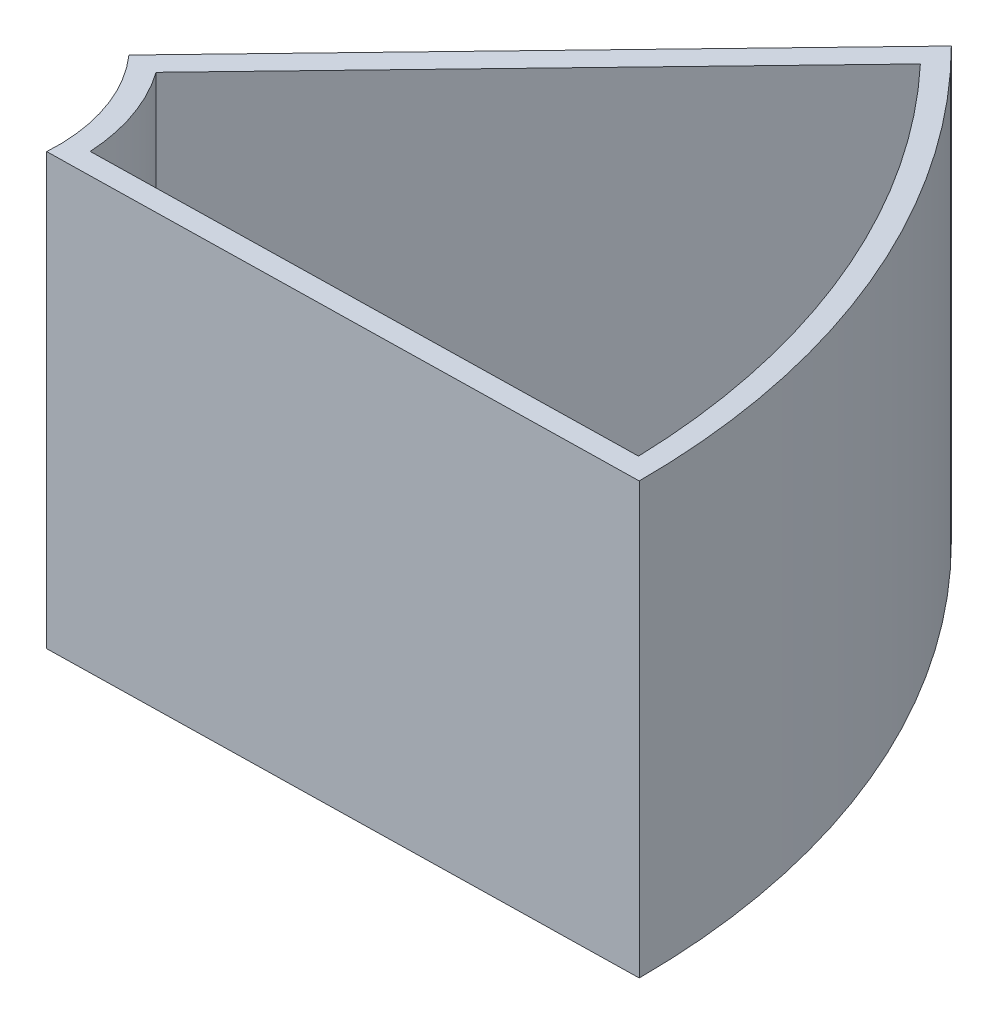
ISO-10303-21;
HEADER;
FILE_DESCRIPTION(('STEP AP214'),'2;1');
FILE_NAME('part.step','',(''),(''),'','','');
FILE_SCHEMA(('AUTOMOTIVE_DESIGN { 1 0 10303 214 1 1 1 1 }'));
ENDSEC;
DATA;
#1=APPLICATION_CONTEXT('core data for automotive mechanical design processes');
#2=APPLICATION_PROTOCOL_DEFINITION('international standard','automotive_design',2000,#1);
#3=PRODUCT_CONTEXT('',#1,'mechanical');
#4=PRODUCT('Part','Part','',(#3));
#5=PRODUCT_RELATED_PRODUCT_CATEGORY('part','',(#4));
#6=PRODUCT_DEFINITION_FORMATION('','',#4);
#7=PRODUCT_DEFINITION_CONTEXT('part definition',#1,'design');
#8=PRODUCT_DEFINITION('design','',#6,#7);
#9=PRODUCT_DEFINITION_SHAPE('','',#8);
#10=(LENGTH_UNIT() NAMED_UNIT(*) SI_UNIT(.MILLI.,.METRE.));
#11=(NAMED_UNIT(*) PLANE_ANGLE_UNIT() SI_UNIT($,.RADIAN.));
#12=(NAMED_UNIT(*) SI_UNIT($,.STERADIAN.) SOLID_ANGLE_UNIT());
#13=UNCERTAINTY_MEASURE_WITH_UNIT(LENGTH_MEASURE(1.E-05),#10,'distance_accuracy_value','');
#14=(GEOMETRIC_REPRESENTATION_CONTEXT(3) GLOBAL_UNCERTAINTY_ASSIGNED_CONTEXT((#13)) GLOBAL_UNIT_ASSIGNED_CONTEXT((#10,
#11,#12)) REPRESENTATION_CONTEXT('',''));
#15=CARTESIAN_POINT('',(0.,0.,0.));
#16=DIRECTION('',(0.,0.,1.));
#17=DIRECTION('',(1.,0.,0.));
#18=AXIS2_PLACEMENT_3D('',#15,#16,#17);
#19=CARTESIAN_POINT('',(0.,100.,0.));
#20=DIRECTION('',(0.,1.,0.));
#21=DIRECTION('',(0.,0.,1.));
#22=AXIS2_PLACEMENT_3D('',#19,#20,#21);
#23=PLANE('',#22);
#24=CARTESIAN_POINT('',(0.,100.,0.));
#25=DIRECTION('',(0.,1.,0.));
#26=DIRECTION('',(0.,0.,1.));
#27=AXIS2_PLACEMENT_3D('',#24,#25,#26);
#28=CIRCLE('',#27,175.);
#29=CARTESIAN_POINT('',(175.,100.,0.));
#30=VERTEX_POINT('',#29);
#31=CARTESIAN_POINT('',(123.743686707646,100.,-123.743686707646));
#32=VERTEX_POINT('',#31);
#33=EDGE_CURVE('E139',#30,#32,#28,.T.);
#34=ORIENTED_EDGE('',*,*,#33,.T.);
#35=DIRECTION('',(-0.693507503530502,0.,0.720449403183104));
#36=VECTOR('',#35,1.);
#37=CARTESIAN_POINT('',(123.743686707646,100.,-123.743686707646));
#38=LINE('',#37,#36);
#39=CARTESIAN_POINT('',(30.045678616437,100.,-26.4056281212505));
#40=VERTEX_POINT('',#39);
#41=EDGE_CURVE('E142',#32,#40,#38,.T.);
#42=ORIENTED_EDGE('',*,*,#41,.T.);
#43=CARTESIAN_POINT('',(0.,100.,0.));
#44=DIRECTION('',(0.,-1.,0.));
#45=DIRECTION('',(0.,0.,1.));
#46=AXIS2_PLACEMENT_3D('',#43,#44,#45);
#47=CIRCLE('',#46,40.);
#48=CARTESIAN_POINT('',(39.9171018010607,100.,2.57390438900788));
#49=VERTEX_POINT('',#48);
#50=EDGE_CURVE('E145',#40,#49,#47,.T.);
#51=ORIENTED_EDGE('',*,*,#50,.T.);
#52=DIRECTION('',(0.999818517042745,0.,-0.0190507999424009));
#53=VECTOR('',#52,1.);
#54=CARTESIAN_POINT('',(175.,100.,0.));
#55=LINE('',#54,#53);
#56=EDGE_CURVE('E147',#49,#30,#55,.T.);
#57=ORIENTED_EDGE('',*,*,#56,.T.);
#58=EDGE_LOOP('',(#34,#42,#51,#57));
#59=FACE_BOUND('',#58,.T.);
#60=DIRECTION('',(0.999818517042745,0.,-0.0190507999424007));
#61=VECTOR('',#60,1.);
#62=CARTESIAN_POINT('',(169.929243976333,100.,-4.9042880861415));
#63=LINE('',#62,#61);
#64=CARTESIAN_POINT('',(44.9292439763331,100.,-2.52250584045592));
#65=VERTEX_POINT('',#64);
#66=CARTESIAN_POINT('',(169.929243976333,100.,-4.90428808614151));
#67=VERTEX_POINT('',#66);
#68=EDGE_CURVE('E128',#65,#67,#63,.T.);
#69=ORIENTED_EDGE('',*,*,#68,.F.);
#70=CARTESIAN_POINT('',(0.,100.,0.));
#71=DIRECTION('',(0.,-1.,0.));
#72=DIRECTION('',(0.,0.,-1.));
#73=AXIS2_PLACEMENT_3D('',#70,#71,#72);
#74=CIRCLE('',#73,45.);
#75=CARTESIAN_POINT('',(36.672129032149,100.,-26.0797805253306));
#76=VERTEX_POINT('',#75);
#77=EDGE_CURVE('E121',#76,#65,#74,.T.);
#78=ORIENTED_EDGE('',*,*,#77,.F.);
#79=DIRECTION('',(-0.693507503530502,0.,0.720449403183104));
#80=VECTOR('',#79,1.);
#81=CARTESIAN_POINT('',(36.672129032149,100.,-26.0797805253306));
#82=LINE('',#81,#80);
#83=CARTESIAN_POINT('',(123.758669753466,100.,-116.549524498612));
#84=VERTEX_POINT('',#83);
#85=EDGE_CURVE('E111',#84,#76,#82,.T.);
#86=ORIENTED_EDGE('',*,*,#85,.F.);
#87=CARTESIAN_POINT('',(0.,100.,0.));
#88=DIRECTION('',(0.,1.,0.));
#89=DIRECTION('',(0.,0.,-1.));
#90=AXIS2_PLACEMENT_3D('',#87,#88,#89);
#91=CIRCLE('',#90,170.);
#92=EDGE_CURVE('E130',#67,#84,#91,.T.);
#93=ORIENTED_EDGE('',*,*,#92,.F.);
#94=EDGE_LOOP('',(#69,#78,#86,#93));
#95=FACE_BOUND('',#94,.T.);
#96=ADVANCED_FACE('F40',(#59,#95),#23,.T.);
#97=CARTESIAN_POINT('',(0.,0.,0.));
#98=DIRECTION('',(0.,1.,0.));
#99=DIRECTION('',(0.,0.,1.));
#100=AXIS2_PLACEMENT_3D('',#97,#98,#99);
#101=PLANE('',#100);
#102=CARTESIAN_POINT('',(0.,0.,0.));
#103=DIRECTION('',(0.,1.,0.));
#104=DIRECTION('',(0.,0.,1.));
#105=AXIS2_PLACEMENT_3D('',#102,#103,#104);
#106=CIRCLE('',#105,175.);
#107=CARTESIAN_POINT('',(175.,0.,0.));
#108=VERTEX_POINT('',#107);
#109=CARTESIAN_POINT('',(123.743686707646,0.,-123.743686707646));
#110=VERTEX_POINT('',#109);
#111=EDGE_CURVE('E138',#108,#110,#106,.T.);
#112=ORIENTED_EDGE('',*,*,#111,.F.);
#113=DIRECTION('',(0.999818517042745,0.,-0.0190507999424009));
#114=VECTOR('',#113,1.);
#115=CARTESIAN_POINT('',(175.,0.,0.));
#116=LINE('',#115,#114);
#117=CARTESIAN_POINT('',(39.9171018010607,0.,2.57390438900788));
#118=VERTEX_POINT('',#117);
#119=EDGE_CURVE('E143',#118,#108,#116,.T.);
#120=ORIENTED_EDGE('',*,*,#119,.F.);
#121=CARTESIAN_POINT('',(0.,0.,0.));
#122=DIRECTION('',(0.,-1.,0.));
#123=DIRECTION('',(0.,0.,1.));
#124=AXIS2_PLACEMENT_3D('',#121,#122,#123);
#125=CIRCLE('',#124,40.);
#126=CARTESIAN_POINT('',(30.045678616437,0.,-26.4056281212505));
#127=VERTEX_POINT('',#126);
#128=EDGE_CURVE('E155',#127,#118,#125,.T.);
#129=ORIENTED_EDGE('',*,*,#128,.F.);
#130=DIRECTION('',(-0.693507503530502,0.,0.720449403183104));
#131=VECTOR('',#130,1.);
#132=CARTESIAN_POINT('',(123.743686707646,0.,-123.743686707646));
#133=LINE('',#132,#131);
#134=EDGE_CURVE('E152',#110,#127,#133,.T.);
#135=ORIENTED_EDGE('',*,*,#134,.F.);
#136=EDGE_LOOP('',(#112,#120,#129,#135));
#137=FACE_BOUND('',#136,.T.);
#138=ADVANCED_FACE('F174',(#137),#101,.F.);
#139=CARTESIAN_POINT('',(0.,100.,0.));
#140=DIRECTION('',(0.,-1.,0.));
#141=DIRECTION('',(0.,0.,-1.));
#142=AXIS2_PLACEMENT_3D('',#139,#140,#141);
#143=CYLINDRICAL_SURFACE('',#142,175.);
#144=DIRECTION('',(0.,-1.,0.));
#145=VECTOR('',#144,1.);
#146=CARTESIAN_POINT('',(175.,100.,0.));
#147=LINE('',#146,#145);
#148=EDGE_CURVE('E149',#30,#108,#147,.T.);
#149=ORIENTED_EDGE('',*,*,#148,.T.);
#150=ORIENTED_EDGE('',*,*,#111,.T.);
#151=DIRECTION('',(0.,-1.,0.));
#152=VECTOR('',#151,1.);
#153=CARTESIAN_POINT('',(123.743686707646,100.,-123.743686707646));
#154=LINE('',#153,#152);
#155=EDGE_CURVE('E48',#32,#110,#154,.T.);
#156=ORIENTED_EDGE('',*,*,#155,.F.);
#157=ORIENTED_EDGE('',*,*,#33,.F.);
#158=EDGE_LOOP('',(#149,#150,#156,#157));
#159=FACE_BOUND('',#158,.T.);
#160=ADVANCED_FACE('F42',(#159),#143,.T.);
#161=CARTESIAN_POINT('',(123.743686707646,100.,-123.743686707646));
#162=DIRECTION('',(0.720449403183104,0.,0.693507503530502));
#163=DIRECTION('',(0.693507503530502,0.,-0.720449403183104));
#164=AXIS2_PLACEMENT_3D('',#161,#162,#163);
#165=PLANE('',#164);
#166=ORIENTED_EDGE('',*,*,#155,.T.);
#167=ORIENTED_EDGE('',*,*,#134,.T.);
#168=DIRECTION('',(0.,-1.,0.));
#169=VECTOR('',#168,1.);
#170=CARTESIAN_POINT('',(30.045678616437,100.,-26.4056281212505));
#171=LINE('',#170,#169);
#172=EDGE_CURVE('E163',#40,#127,#171,.T.);
#173=ORIENTED_EDGE('',*,*,#172,.F.);
#174=ORIENTED_EDGE('',*,*,#41,.F.);
#175=EDGE_LOOP('',(#166,#167,#173,#174));
#176=FACE_BOUND('',#175,.T.);
#177=ADVANCED_FACE('F167',(#176),#165,.F.);
#178=CARTESIAN_POINT('',(0.,100.,0.));
#179=DIRECTION('',(0.,-1.,0.));
#180=DIRECTION('',(0.,0.,-1.));
#181=AXIS2_PLACEMENT_3D('',#178,#179,#180);
#182=CYLINDRICAL_SURFACE('',#181,40.);
#183=ORIENTED_EDGE('',*,*,#172,.T.);
#184=ORIENTED_EDGE('',*,*,#128,.T.);
#185=DIRECTION('',(0.,-1.,0.));
#186=VECTOR('',#185,1.);
#187=CARTESIAN_POINT('',(39.9171018010607,100.,2.57390438900788));
#188=LINE('',#187,#186);
#189=EDGE_CURVE('E161',#49,#118,#188,.T.);
#190=ORIENTED_EDGE('',*,*,#189,.F.);
#191=ORIENTED_EDGE('',*,*,#50,.F.);
#192=EDGE_LOOP('',(#183,#184,#190,#191));
#193=FACE_BOUND('',#192,.T.);
#194=ADVANCED_FACE('F183',(#193),#182,.F.);
#195=CARTESIAN_POINT('',(175.,100.,0.));
#196=DIRECTION('',(-0.0190507999424009,0.,-0.999818517042745));
#197=DIRECTION('',(-0.999818517042746,0.,0.0190507999424009));
#198=AXIS2_PLACEMENT_3D('',#195,#196,#197);
#199=PLANE('',#198);
#200=ORIENTED_EDGE('',*,*,#189,.T.);
#201=ORIENTED_EDGE('',*,*,#119,.T.);
#202=ORIENTED_EDGE('',*,*,#148,.F.);
#203=ORIENTED_EDGE('',*,*,#56,.F.);
#204=EDGE_LOOP('',(#200,#201,#202,#203));
#205=FACE_BOUND('',#204,.T.);
#206=ADVANCED_FACE('F179',(#205),#199,.F.);
#207=CARTESIAN_POINT('',(0.,100.,0.));
#208=DIRECTION('',(0.,-1.,0.));
#209=DIRECTION('',(0.,0.,-1.));
#210=AXIS2_PLACEMENT_3D('',#207,#208,#209);
#211=CYLINDRICAL_SURFACE('',#210,45.);
#212=CARTESIAN_POINT('',(0.,15.,0.));
#213=DIRECTION('',(0.,1.,0.));
#214=DIRECTION('',(0.,0.,1.));
#215=AXIS2_PLACEMENT_3D('',#212,#213,#214);
#216=CIRCLE('',#215,45.);
#217=CARTESIAN_POINT('',(36.672129032149,15.,-26.0797805253306));
#218=VERTEX_POINT('',#217);
#219=CARTESIAN_POINT('',(44.9292439763331,15.,-2.52250584045592));
#220=VERTEX_POINT('',#219);
#221=EDGE_CURVE('E117',#218,#220,#216,.F.);
#222=ORIENTED_EDGE('',*,*,#221,.F.);
#223=DIRECTION('',(0.,-1.,0.));
#224=VECTOR('',#223,1.);
#225=CARTESIAN_POINT('',(36.672129032149,100.,-26.0797805253306));
#226=LINE('',#225,#224);
#227=EDGE_CURVE('E107',#76,#218,#226,.T.);
#228=ORIENTED_EDGE('',*,*,#227,.F.);
#229=ORIENTED_EDGE('',*,*,#77,.T.);
#230=DIRECTION('',(0.,-1.,0.));
#231=VECTOR('',#230,1.);
#232=CARTESIAN_POINT('',(44.9292439763331,100.,-2.52250584045592));
#233=LINE('',#232,#231);
#234=EDGE_CURVE('E119',#65,#220,#233,.T.);
#235=ORIENTED_EDGE('',*,*,#234,.T.);
#236=EDGE_LOOP('',(#222,#228,#229,#235));
#237=FACE_BOUND('',#236,.T.);
#238=ADVANCED_FACE('F118',(#237),#211,.T.);
#239=CARTESIAN_POINT('',(169.929243976333,100.,-4.9042880861415));
#240=DIRECTION('',(-0.0190507999424007,0.,-0.999818517042745));
#241=DIRECTION('',(-0.999818517042745,0.,0.0190507999424007));
#242=AXIS2_PLACEMENT_3D('',#239,#240,#241);
#243=PLANE('',#242);
#244=DIRECTION('',(0.999818517042745,0.,-0.0190507999424007));
#245=VECTOR('',#244,1.);
#246=CARTESIAN_POINT('',(169.929243976333,15.,-4.9042880861415));
#247=LINE('',#246,#245);
#248=CARTESIAN_POINT('',(169.929243976333,15.,-4.90428808614151));
#249=VERTEX_POINT('',#248);
#250=EDGE_CURVE('E55',#220,#249,#247,.T.);
#251=ORIENTED_EDGE('',*,*,#250,.F.);
#252=ORIENTED_EDGE('',*,*,#234,.F.);
#253=ORIENTED_EDGE('',*,*,#68,.T.);
#254=DIRECTION('',(0.,-1.,0.));
#255=VECTOR('',#254,1.);
#256=CARTESIAN_POINT('',(169.929243976333,100.,-4.90428808614151));
#257=LINE('',#256,#255);
#258=EDGE_CURVE('E135',#67,#249,#257,.T.);
#259=ORIENTED_EDGE('',*,*,#258,.T.);
#260=EDGE_LOOP('',(#251,#252,#253,#259));
#261=FACE_BOUND('',#260,.T.);
#262=ADVANCED_FACE('F190',(#261),#243,.T.);
#263=CARTESIAN_POINT('',(0.,100.,0.));
#264=DIRECTION('',(0.,-1.,0.));
#265=DIRECTION('',(0.,0.,-1.));
#266=AXIS2_PLACEMENT_3D('',#263,#264,#265);
#267=CYLINDRICAL_SURFACE('',#266,170.);
#268=CARTESIAN_POINT('',(0.,15.,0.));
#269=DIRECTION('',(0.,1.,0.));
#270=DIRECTION('',(0.,0.,1.));
#271=AXIS2_PLACEMENT_3D('',#268,#269,#270);
#272=CIRCLE('',#271,170.);
#273=CARTESIAN_POINT('',(123.758669753466,15.,-116.549524498612));
#274=VERTEX_POINT('',#273);
#275=EDGE_CURVE('E63',#249,#274,#272,.T.);
#276=ORIENTED_EDGE('',*,*,#275,.F.);
#277=ORIENTED_EDGE('',*,*,#258,.F.);
#278=ORIENTED_EDGE('',*,*,#92,.T.);
#279=DIRECTION('',(0.,-1.,0.));
#280=VECTOR('',#279,1.);
#281=CARTESIAN_POINT('',(123.758669753466,100.,-116.549524498612));
#282=LINE('',#281,#280);
#283=EDGE_CURVE('E114',#84,#274,#282,.T.);
#284=ORIENTED_EDGE('',*,*,#283,.T.);
#285=EDGE_LOOP('',(#276,#277,#278,#284));
#286=FACE_BOUND('',#285,.T.);
#287=ADVANCED_FACE('F191',(#286),#267,.F.);
#288=CARTESIAN_POINT('',(36.672129032149,100.,-26.0797805253306));
#289=DIRECTION('',(0.720449403183104,0.,0.693507503530502));
#290=DIRECTION('',(0.693507503530502,0.,-0.720449403183104));
#291=AXIS2_PLACEMENT_3D('',#288,#289,#290);
#292=PLANE('',#291);
#293=DIRECTION('',(-0.693507503530502,0.,0.720449403183104));
#294=VECTOR('',#293,1.);
#295=CARTESIAN_POINT('',(36.672129032149,15.,-26.0797805253306));
#296=LINE('',#295,#294);
#297=EDGE_CURVE('E11',#274,#218,#296,.T.);
#298=ORIENTED_EDGE('',*,*,#297,.F.);
#299=ORIENTED_EDGE('',*,*,#283,.F.);
#300=ORIENTED_EDGE('',*,*,#85,.T.);
#301=ORIENTED_EDGE('',*,*,#227,.T.);
#302=EDGE_LOOP('',(#298,#299,#300,#301));
#303=FACE_BOUND('',#302,.T.);
#304=ADVANCED_FACE('F109',(#303),#292,.T.);
#305=CARTESIAN_POINT('',(0.,15.,0.));
#306=DIRECTION('',(0.,1.,0.));
#307=DIRECTION('',(0.,0.,1.));
#308=AXIS2_PLACEMENT_3D('',#305,#306,#307);
#309=PLANE('',#308);
#310=ORIENTED_EDGE('',*,*,#297,.T.);
#311=ORIENTED_EDGE('',*,*,#221,.T.);
#312=ORIENTED_EDGE('',*,*,#250,.T.);
#313=ORIENTED_EDGE('',*,*,#275,.T.);
#314=EDGE_LOOP('',(#310,#311,#312,#313));
#315=FACE_BOUND('',#314,.T.);
#316=ADVANCED_FACE('F123',(#315),#309,.T.);
#317=CLOSED_SHELL('',(#96,#138,#160,#177,#194,#206,#238,#262,#287,#304,#316));
#318=MANIFOLD_SOLID_BREP('B2',#317);
#319=ADVANCED_BREP_SHAPE_REPRESENTATION('',(#18,#318),#14);
#320=SHAPE_DEFINITION_REPRESENTATION(#9,#319);
ENDSEC;
END-ISO-10303-21;
